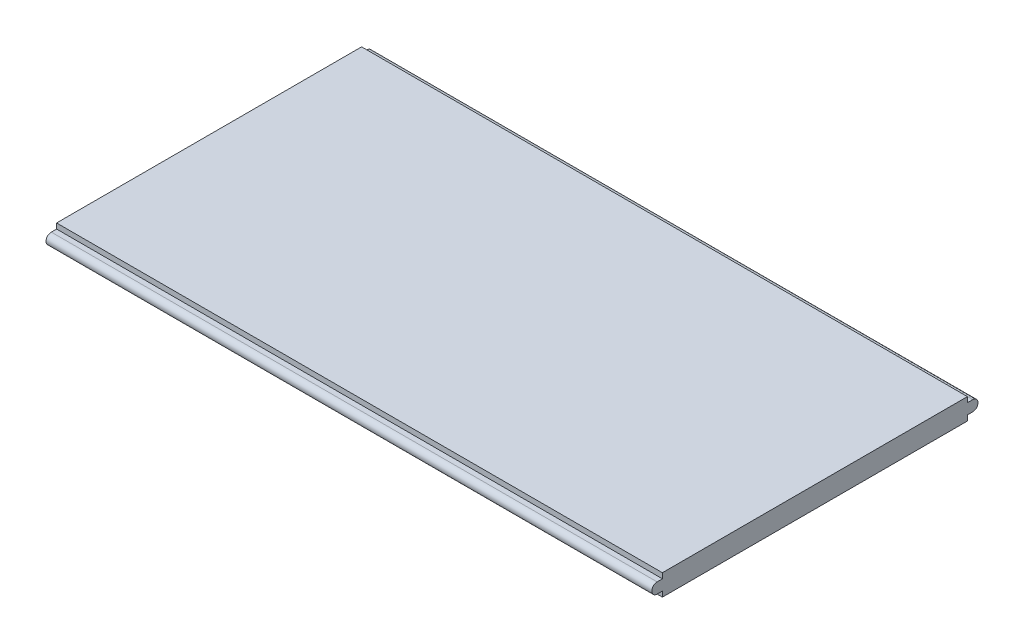
ISO-10303-21;
HEADER;
FILE_DESCRIPTION(('STEP AP214'),'2;1');
FILE_NAME('part.step','',(''),(''),'','','');
FILE_SCHEMA(('AUTOMOTIVE_DESIGN { 1 0 10303 214 1 1 1 1 }'));
ENDSEC;
DATA;
#1=APPLICATION_CONTEXT('core data for automotive mechanical design processes');
#2=APPLICATION_PROTOCOL_DEFINITION('international standard','automotive_design',2000,#1);
#3=PRODUCT_CONTEXT('',#1,'mechanical');
#4=PRODUCT('Part','Part','',(#3));
#5=PRODUCT_RELATED_PRODUCT_CATEGORY('part','',(#4));
#6=PRODUCT_DEFINITION_FORMATION('','',#4);
#7=PRODUCT_DEFINITION_CONTEXT('part definition',#1,'design');
#8=PRODUCT_DEFINITION('design','',#6,#7);
#9=PRODUCT_DEFINITION_SHAPE('','',#8);
#10=(LENGTH_UNIT() NAMED_UNIT(*) SI_UNIT(.MILLI.,.METRE.));
#11=(NAMED_UNIT(*) PLANE_ANGLE_UNIT() SI_UNIT($,.RADIAN.));
#12=(NAMED_UNIT(*) SI_UNIT($,.STERADIAN.) SOLID_ANGLE_UNIT());
#13=UNCERTAINTY_MEASURE_WITH_UNIT(LENGTH_MEASURE(1.E-05),#10,'distance_accuracy_value','');
#14=(GEOMETRIC_REPRESENTATION_CONTEXT(3) GLOBAL_UNCERTAINTY_ASSIGNED_CONTEXT((#13)) GLOBAL_UNIT_ASSIGNED_CONTEXT((#10,
#11,#12)) REPRESENTATION_CONTEXT('',''));
#15=CARTESIAN_POINT('',(0.,0.,0.));
#16=DIRECTION('',(0.,0.,1.));
#17=DIRECTION('',(1.,0.,0.));
#18=AXIS2_PLACEMENT_3D('',#15,#16,#17);
#19=CARTESIAN_POINT('',(1430.,0.,-360.));
#20=DIRECTION('',(0.,0.,-1.));
#21=DIRECTION('',(-1.,0.,0.));
#22=AXIS2_PLACEMENT_3D('',#19,#20,#21);
#23=PLANE('',#22);
#24=DIRECTION('',(0.,-1.,0.));
#25=VECTOR('',#24,1.);
#26=CARTESIAN_POINT('',(0.,0.,-360.));
#27=LINE('',#26,#25);
#28=CARTESIAN_POINT('',(0.,-12.5,-360.));
#29=VERTEX_POINT('',#28);
#30=CARTESIAN_POINT('',(0.,-24.9999999999999,-360.));
#31=VERTEX_POINT('',#30);
#32=EDGE_CURVE('E253',#29,#31,#27,.T.);
#33=ORIENTED_EDGE('',*,*,#32,.F.);
#34=DIRECTION('',(-1.,0.,0.));
#35=VECTOR('',#34,1.);
#36=CARTESIAN_POINT('',(1430.,-12.5,-360.));
#37=LINE('',#36,#35);
#38=CARTESIAN_POINT('',(1430.,-12.5,-360.));
#39=VERTEX_POINT('',#38);
#40=EDGE_CURVE('E11',#39,#29,#37,.T.);
#41=ORIENTED_EDGE('',*,*,#40,.F.);
#42=DIRECTION('',(0.,-1.,0.));
#43=VECTOR('',#42,1.);
#44=CARTESIAN_POINT('',(1430.,0.,-360.));
#45=LINE('',#44,#43);
#46=CARTESIAN_POINT('',(1430.,-24.9999999999999,-360.));
#47=VERTEX_POINT('',#46);
#48=EDGE_CURVE('E182',#39,#47,#45,.T.);
#49=ORIENTED_EDGE('',*,*,#48,.T.);
#50=DIRECTION('',(-1.,0.,0.));
#51=VECTOR('',#50,1.);
#52=CARTESIAN_POINT('',(1430.,-24.9999999999999,-360.));
#53=LINE('',#52,#51);
#54=EDGE_CURVE('E106',#47,#31,#53,.T.);
#55=ORIENTED_EDGE('',*,*,#54,.T.);
#56=EDGE_LOOP('',(#33,#41,#49,#55));
#57=FACE_BOUND('',#56,.T.);
#58=ADVANCED_FACE('F41',(#57),#23,.T.);
#59=CARTESIAN_POINT('',(1430.,-12.5000000000001,0.));
#60=DIRECTION('',(0.,1.,0.));
#61=DIRECTION('',(0.,0.,1.));
#62=AXIS2_PLACEMENT_3D('',#59,#60,#61);
#63=PLANE('',#62);
#64=DIRECTION('',(0.,0.,-1.));
#65=VECTOR('',#64,1.);
#66=CARTESIAN_POINT('',(0.,-12.5000000000001,0.));
#67=LINE('',#66,#65);
#68=CARTESIAN_POINT('',(0.,-12.5,-372.5));
#69=VERTEX_POINT('',#68);
#70=EDGE_CURVE('E243',#29,#69,#67,.T.);
#71=ORIENTED_EDGE('',*,*,#70,.T.);
#72=DIRECTION('',(-1.,0.,0.));
#73=VECTOR('',#72,1.);
#74=CARTESIAN_POINT('',(1430.,-12.5,-372.5));
#75=LINE('',#74,#73);
#76=CARTESIAN_POINT('',(1430.,-12.5,-372.5));
#77=VERTEX_POINT('',#76);
#78=EDGE_CURVE('E51',#77,#69,#75,.T.);
#79=ORIENTED_EDGE('',*,*,#78,.F.);
#80=DIRECTION('',(0.,0.,-1.));
#81=VECTOR('',#80,1.);
#82=CARTESIAN_POINT('',(1430.,-12.5000000000001,0.));
#83=LINE('',#82,#81);
#84=EDGE_CURVE('E190',#39,#77,#83,.T.);
#85=ORIENTED_EDGE('',*,*,#84,.F.);
#86=ORIENTED_EDGE('',*,*,#40,.T.);
#87=EDGE_LOOP('',(#71,#79,#85,#86));
#88=FACE_BOUND('',#87,.T.);
#89=ADVANCED_FACE('F43',(#88),#63,.F.);
#90=CARTESIAN_POINT('',(1430.,0.,-372.5));
#91=DIRECTION('',(-1.,0.,0.));
#92=DIRECTION('',(0.,0.,1.));
#93=AXIS2_PLACEMENT_3D('',#90,#91,#92);
#94=CYLINDRICAL_SURFACE('',#93,12.5);
#95=CARTESIAN_POINT('',(0.,0.,-372.5));
#96=DIRECTION('',(1.,0.,0.));
#97=DIRECTION('',(0.,0.,-1.));
#98=AXIS2_PLACEMENT_3D('',#95,#96,#97);
#99=CIRCLE('',#98,12.5);
#100=CARTESIAN_POINT('',(0.,12.5,-372.5));
#101=VERTEX_POINT('',#100);
#102=EDGE_CURVE('E237',#69,#101,#99,.T.);
#103=ORIENTED_EDGE('',*,*,#102,.T.);
#104=DIRECTION('',(-1.,0.,0.));
#105=VECTOR('',#104,1.);
#106=CARTESIAN_POINT('',(1430.,12.5,-372.5));
#107=LINE('',#106,#105);
#108=CARTESIAN_POINT('',(1430.,12.5,-372.5));
#109=VERTEX_POINT('',#108);
#110=EDGE_CURVE('E226',#109,#101,#107,.T.);
#111=ORIENTED_EDGE('',*,*,#110,.F.);
#112=CARTESIAN_POINT('',(1430.,0.,-372.5));
#113=DIRECTION('',(1.,0.,0.));
#114=DIRECTION('',(0.,0.,-1.));
#115=AXIS2_PLACEMENT_3D('',#112,#113,#114);
#116=CIRCLE('',#115,12.5);
#117=EDGE_CURVE('E187',#77,#109,#116,.T.);
#118=ORIENTED_EDGE('',*,*,#117,.F.);
#119=ORIENTED_EDGE('',*,*,#78,.T.);
#120=EDGE_LOOP('',(#103,#111,#118,#119));
#121=FACE_BOUND('',#120,.T.);
#122=ADVANCED_FACE('F235',(#121),#94,.T.);
#123=CARTESIAN_POINT('',(1430.,12.4999999999999,0.));
#124=DIRECTION('',(0.,1.,0.));
#125=DIRECTION('',(0.,0.,1.));
#126=AXIS2_PLACEMENT_3D('',#123,#124,#125);
#127=PLANE('',#126);
#128=DIRECTION('',(0.,0.,-1.));
#129=VECTOR('',#128,1.);
#130=CARTESIAN_POINT('',(0.,12.4999999999999,0.));
#131=LINE('',#130,#129);
#132=CARTESIAN_POINT('',(0.,12.5,-360.));
#133=VERTEX_POINT('',#132);
#134=EDGE_CURVE('E246',#133,#101,#131,.T.);
#135=ORIENTED_EDGE('',*,*,#134,.F.);
#136=DIRECTION('',(-1.,0.,0.));
#137=VECTOR('',#136,1.);
#138=CARTESIAN_POINT('',(1430.,12.5,-360.));
#139=LINE('',#138,#137);
#140=CARTESIAN_POINT('',(1430.,12.5,-360.));
#141=VERTEX_POINT('',#140);
#142=EDGE_CURVE('E223',#141,#133,#139,.T.);
#143=ORIENTED_EDGE('',*,*,#142,.F.);
#144=DIRECTION('',(0.,0.,-1.));
#145=VECTOR('',#144,1.);
#146=CARTESIAN_POINT('',(1430.,12.4999999999999,0.));
#147=LINE('',#146,#145);
#148=EDGE_CURVE('E180',#141,#109,#147,.T.);
#149=ORIENTED_EDGE('',*,*,#148,.T.);
#150=ORIENTED_EDGE('',*,*,#110,.T.);
#151=EDGE_LOOP('',(#135,#143,#149,#150));
#152=FACE_BOUND('',#151,.T.);
#153=ADVANCED_FACE('F283',(#152),#127,.T.);
#154=CARTESIAN_POINT('',(0.,24.9999999999999,-360.));
#155=VERTEX_POINT('',#154);
#156=EDGE_CURVE('E251',#155,#133,#27,.T.);
#157=ORIENTED_EDGE('',*,*,#156,.F.);
#158=DIRECTION('',(-1.,0.,0.));
#159=VECTOR('',#158,1.);
#160=CARTESIAN_POINT('',(1430.,24.9999999999999,-360.));
#161=LINE('',#160,#159);
#162=CARTESIAN_POINT('',(1430.,24.9999999999999,-360.));
#163=VERTEX_POINT('',#162);
#164=EDGE_CURVE('E220',#163,#155,#161,.T.);
#165=ORIENTED_EDGE('',*,*,#164,.F.);
#166=EDGE_CURVE('E176',#163,#141,#45,.T.);
#167=ORIENTED_EDGE('',*,*,#166,.T.);
#168=ORIENTED_EDGE('',*,*,#142,.T.);
#169=EDGE_LOOP('',(#157,#165,#167,#168));
#170=FACE_BOUND('',#169,.T.);
#171=ADVANCED_FACE('F279',(#170),#23,.T.);
#172=CARTESIAN_POINT('',(1430.,25.,0.));
#173=DIRECTION('',(0.,1.,0.));
#174=DIRECTION('',(0.,0.,1.));
#175=AXIS2_PLACEMENT_3D('',#172,#173,#174);
#176=PLANE('',#175);
#177=DIRECTION('',(0.,0.,-1.));
#178=VECTOR('',#177,1.);
#179=CARTESIAN_POINT('',(0.,25.,0.));
#180=LINE('',#179,#178);
#181=CARTESIAN_POINT('',(0.,25.0000000000001,360.));
#182=VERTEX_POINT('',#181);
#183=EDGE_CURVE('E257',#182,#155,#180,.T.);
#184=ORIENTED_EDGE('',*,*,#183,.F.);
#185=DIRECTION('',(-1.,0.,0.));
#186=VECTOR('',#185,1.);
#187=CARTESIAN_POINT('',(1430.,25.0000000000001,360.));
#188=LINE('',#187,#186);
#189=CARTESIAN_POINT('',(1430.,25.0000000000001,360.));
#190=VERTEX_POINT('',#189);
#191=EDGE_CURVE('E217',#190,#182,#188,.T.);
#192=ORIENTED_EDGE('',*,*,#191,.F.);
#193=DIRECTION('',(0.,0.,-1.));
#194=VECTOR('',#193,1.);
#195=CARTESIAN_POINT('',(1430.,25.,0.));
#196=LINE('',#195,#194);
#197=EDGE_CURVE('E168',#190,#163,#196,.T.);
#198=ORIENTED_EDGE('',*,*,#197,.T.);
#199=ORIENTED_EDGE('',*,*,#164,.T.);
#200=EDGE_LOOP('',(#184,#192,#198,#199));
#201=FACE_BOUND('',#200,.T.);
#202=ADVANCED_FACE('F295',(#201),#176,.T.);
#203=CARTESIAN_POINT('',(1430.,0.,360.));
#204=DIRECTION('',(0.,0.,-1.));
#205=DIRECTION('',(-1.,0.,0.));
#206=AXIS2_PLACEMENT_3D('',#203,#204,#205);
#207=PLANE('',#206);
#208=DIRECTION('',(0.,-1.,0.));
#209=VECTOR('',#208,1.);
#210=CARTESIAN_POINT('',(0.,0.,360.));
#211=LINE('',#210,#209);
#212=CARTESIAN_POINT('',(0.,12.5,360.));
#213=VERTEX_POINT('',#212);
#214=EDGE_CURVE('E201',#182,#213,#211,.T.);
#215=ORIENTED_EDGE('',*,*,#214,.T.);
#216=DIRECTION('',(-1.,0.,0.));
#217=VECTOR('',#216,1.);
#218=CARTESIAN_POINT('',(1430.,12.5,360.));
#219=LINE('',#218,#217);
#220=CARTESIAN_POINT('',(1430.,12.5,360.));
#221=VERTEX_POINT('',#220);
#222=EDGE_CURVE('E214',#221,#213,#219,.T.);
#223=ORIENTED_EDGE('',*,*,#222,.F.);
#224=DIRECTION('',(0.,-1.,0.));
#225=VECTOR('',#224,1.);
#226=CARTESIAN_POINT('',(1430.,0.,360.));
#227=LINE('',#226,#225);
#228=EDGE_CURVE('E161',#190,#221,#227,.T.);
#229=ORIENTED_EDGE('',*,*,#228,.F.);
#230=ORIENTED_EDGE('',*,*,#191,.T.);
#231=EDGE_LOOP('',(#215,#223,#229,#230));
#232=FACE_BOUND('',#231,.T.);
#233=ADVANCED_FACE('F300',(#232),#207,.F.);
#234=CARTESIAN_POINT('',(1430.,12.5,0.));
#235=DIRECTION('',(0.,1.,0.));
#236=DIRECTION('',(0.,0.,1.));
#237=AXIS2_PLACEMENT_3D('',#234,#235,#236);
#238=PLANE('',#237);
#239=DIRECTION('',(0.,0.,-1.));
#240=VECTOR('',#239,1.);
#241=CARTESIAN_POINT('',(0.,12.5,0.));
#242=LINE('',#241,#240);
#243=CARTESIAN_POINT('',(0.,12.5,372.5));
#244=VERTEX_POINT('',#243);
#245=EDGE_CURVE('E263',#244,#213,#242,.T.);
#246=ORIENTED_EDGE('',*,*,#245,.F.);
#247=DIRECTION('',(-1.,0.,0.));
#248=VECTOR('',#247,1.);
#249=CARTESIAN_POINT('',(1430.,12.5,372.5));
#250=LINE('',#249,#248);
#251=CARTESIAN_POINT('',(1430.,12.5,372.5));
#252=VERTEX_POINT('',#251);
#253=EDGE_CURVE('E211',#252,#244,#250,.T.);
#254=ORIENTED_EDGE('',*,*,#253,.F.);
#255=DIRECTION('',(0.,0.,-1.));
#256=VECTOR('',#255,1.);
#257=CARTESIAN_POINT('',(1430.,12.5,0.));
#258=LINE('',#257,#256);
#259=EDGE_CURVE('E167',#252,#221,#258,.T.);
#260=ORIENTED_EDGE('',*,*,#259,.T.);
#261=ORIENTED_EDGE('',*,*,#222,.T.);
#262=EDGE_LOOP('',(#246,#254,#260,#261));
#263=FACE_BOUND('',#262,.T.);
#264=ADVANCED_FACE('F336',(#263),#238,.T.);
#265=CARTESIAN_POINT('',(1430.,0.,372.5));
#266=DIRECTION('',(-1.,0.,0.));
#267=DIRECTION('',(0.,0.,1.));
#268=AXIS2_PLACEMENT_3D('',#265,#266,#267);
#269=CYLINDRICAL_SURFACE('',#268,12.5);
#270=CARTESIAN_POINT('',(0.,0.,372.5));
#271=DIRECTION('',(1.,0.,0.));
#272=DIRECTION('',(0.,0.,-1.));
#273=AXIS2_PLACEMENT_3D('',#270,#271,#272);
#274=CIRCLE('',#273,12.5);
#275=CARTESIAN_POINT('',(0.,-12.5,372.5));
#276=VERTEX_POINT('',#275);
#277=EDGE_CURVE('E266',#244,#276,#274,.T.);
#278=ORIENTED_EDGE('',*,*,#277,.T.);
#279=DIRECTION('',(-1.,0.,0.));
#280=VECTOR('',#279,1.);
#281=CARTESIAN_POINT('',(1430.,-12.5,372.5));
#282=LINE('',#281,#280);
#283=CARTESIAN_POINT('',(1430.,-12.5,372.5));
#284=VERTEX_POINT('',#283);
#285=EDGE_CURVE('E155',#284,#276,#282,.T.);
#286=ORIENTED_EDGE('',*,*,#285,.F.);
#287=CARTESIAN_POINT('',(1430.,0.,372.5));
#288=DIRECTION('',(1.,0.,0.));
#289=DIRECTION('',(0.,0.,-1.));
#290=AXIS2_PLACEMENT_3D('',#287,#288,#289);
#291=CIRCLE('',#290,12.5);
#292=EDGE_CURVE('E144',#252,#284,#291,.T.);
#293=ORIENTED_EDGE('',*,*,#292,.F.);
#294=ORIENTED_EDGE('',*,*,#253,.T.);
#295=EDGE_LOOP('',(#278,#286,#293,#294));
#296=FACE_BOUND('',#295,.T.);
#297=ADVANCED_FACE('F271',(#296),#269,.T.);
#298=CARTESIAN_POINT('',(1430.,-12.5,0.));
#299=DIRECTION('',(0.,1.,0.));
#300=DIRECTION('',(0.,0.,1.));
#301=AXIS2_PLACEMENT_3D('',#298,#299,#300);
#302=PLANE('',#301);
#303=DIRECTION('',(0.,0.,-1.));
#304=VECTOR('',#303,1.);
#305=CARTESIAN_POINT('',(0.,-12.5,0.));
#306=LINE('',#305,#304);
#307=CARTESIAN_POINT('',(0.,-12.5,360.));
#308=VERTEX_POINT('',#307);
#309=EDGE_CURVE('E153',#276,#308,#306,.T.);
#310=ORIENTED_EDGE('',*,*,#309,.T.);
#311=DIRECTION('',(-1.,0.,0.));
#312=VECTOR('',#311,1.);
#313=CARTESIAN_POINT('',(1430.,-12.5,360.));
#314=LINE('',#313,#312);
#315=CARTESIAN_POINT('',(1430.,-12.5,360.));
#316=VERTEX_POINT('',#315);
#317=EDGE_CURVE('E150',#316,#308,#314,.T.);
#318=ORIENTED_EDGE('',*,*,#317,.F.);
#319=DIRECTION('',(0.,0.,-1.));
#320=VECTOR('',#319,1.);
#321=CARTESIAN_POINT('',(1430.,-12.5,0.));
#322=LINE('',#321,#320);
#323=EDGE_CURVE('E137',#284,#316,#322,.T.);
#324=ORIENTED_EDGE('',*,*,#323,.F.);
#325=ORIENTED_EDGE('',*,*,#285,.T.);
#326=EDGE_LOOP('',(#310,#318,#324,#325));
#327=FACE_BOUND('',#326,.T.);
#328=ADVANCED_FACE('F151',(#327),#302,.F.);
#329=CARTESIAN_POINT('',(0.,-24.9999999999999,360.));
#330=VERTEX_POINT('',#329);
#331=EDGE_CURVE('E99',#308,#330,#211,.T.);
#332=ORIENTED_EDGE('',*,*,#331,.T.);
#333=DIRECTION('',(-1.,0.,0.));
#334=VECTOR('',#333,1.);
#335=CARTESIAN_POINT('',(1430.,-24.9999999999999,360.));
#336=LINE('',#335,#334);
#337=CARTESIAN_POINT('',(1430.,-24.9999999999999,360.));
#338=VERTEX_POINT('',#337);
#339=EDGE_CURVE('E156',#338,#330,#336,.T.);
#340=ORIENTED_EDGE('',*,*,#339,.F.);
#341=EDGE_CURVE('E141',#316,#338,#227,.T.);
#342=ORIENTED_EDGE('',*,*,#341,.F.);
#343=ORIENTED_EDGE('',*,*,#317,.T.);
#344=EDGE_LOOP('',(#332,#340,#342,#343));
#345=FACE_BOUND('',#344,.T.);
#346=ADVANCED_FACE('F158',(#345),#207,.F.);
#347=CARTESIAN_POINT('',(1430.,-24.9999999999999,0.));
#348=DIRECTION('',(0.,1.,0.));
#349=DIRECTION('',(0.,0.,1.));
#350=AXIS2_PLACEMENT_3D('',#347,#348,#349);
#351=PLANE('',#350);
#352=DIRECTION('',(0.,0.,-1.));
#353=VECTOR('',#352,1.);
#354=CARTESIAN_POINT('',(0.,-24.9999999999999,0.));
#355=LINE('',#354,#353);
#356=EDGE_CURVE('E193',#330,#31,#355,.T.);
#357=ORIENTED_EDGE('',*,*,#356,.T.);
#358=ORIENTED_EDGE('',*,*,#54,.F.);
#359=DIRECTION('',(0.,0.,-1.));
#360=VECTOR('',#359,1.);
#361=CARTESIAN_POINT('',(1430.,-24.9999999999999,0.));
#362=LINE('',#361,#360);
#363=EDGE_CURVE('E59',#338,#47,#362,.T.);
#364=ORIENTED_EDGE('',*,*,#363,.F.);
#365=ORIENTED_EDGE('',*,*,#339,.T.);
#366=EDGE_LOOP('',(#357,#358,#364,#365));
#367=FACE_BOUND('',#366,.T.);
#368=ADVANCED_FACE('F367',(#367),#351,.F.);
#369=CARTESIAN_POINT('',(1430.,0.,0.));
#370=DIRECTION('',(1.,0.,0.));
#371=DIRECTION('',(0.,0.,-1.));
#372=AXIS2_PLACEMENT_3D('',#369,#370,#371);
#373=PLANE('',#372);
#374=ORIENTED_EDGE('',*,*,#48,.F.);
#375=ORIENTED_EDGE('',*,*,#84,.T.);
#376=ORIENTED_EDGE('',*,*,#117,.T.);
#377=ORIENTED_EDGE('',*,*,#148,.F.);
#378=ORIENTED_EDGE('',*,*,#166,.F.);
#379=ORIENTED_EDGE('',*,*,#197,.F.);
#380=ORIENTED_EDGE('',*,*,#228,.T.);
#381=ORIENTED_EDGE('',*,*,#259,.F.);
#382=ORIENTED_EDGE('',*,*,#292,.T.);
#383=ORIENTED_EDGE('',*,*,#323,.T.);
#384=ORIENTED_EDGE('',*,*,#341,.T.);
#385=ORIENTED_EDGE('',*,*,#363,.T.);
#386=EDGE_LOOP('',(#374,#375,#376,#377,#378,#379,#380,#381,#382,#383,#384,#385));
#387=FACE_BOUND('',#386,.T.);
#388=ADVANCED_FACE('F139',(#387),#373,.T.);
#389=CARTESIAN_POINT('',(0.,0.,0.));
#390=DIRECTION('',(1.,0.,0.));
#391=DIRECTION('',(0.,0.,-1.));
#392=AXIS2_PLACEMENT_3D('',#389,#390,#391);
#393=PLANE('',#392);
#394=ORIENTED_EDGE('',*,*,#32,.T.);
#395=ORIENTED_EDGE('',*,*,#356,.F.);
#396=ORIENTED_EDGE('',*,*,#331,.F.);
#397=ORIENTED_EDGE('',*,*,#309,.F.);
#398=ORIENTED_EDGE('',*,*,#277,.F.);
#399=ORIENTED_EDGE('',*,*,#245,.T.);
#400=ORIENTED_EDGE('',*,*,#214,.F.);
#401=ORIENTED_EDGE('',*,*,#183,.T.);
#402=ORIENTED_EDGE('',*,*,#156,.T.);
#403=ORIENTED_EDGE('',*,*,#134,.T.);
#404=ORIENTED_EDGE('',*,*,#102,.F.);
#405=ORIENTED_EDGE('',*,*,#70,.F.);
#406=EDGE_LOOP('',(#394,#395,#396,#397,#398,#399,#400,#401,#402,#403,#404,#405));
#407=FACE_BOUND('',#406,.T.);
#408=ADVANCED_FACE('F242',(#407),#393,.F.);
#409=CLOSED_SHELL('',(#58,#89,#122,#153,#171,#202,#233,#264,#297,#328,#346,#368,#388,#408));
#410=MANIFOLD_SOLID_BREP('B2',#409);
#411=ADVANCED_BREP_SHAPE_REPRESENTATION('',(#18,#410),#14);
#412=SHAPE_DEFINITION_REPRESENTATION(#9,#411);
ENDSEC;
END-ISO-10303-21;
